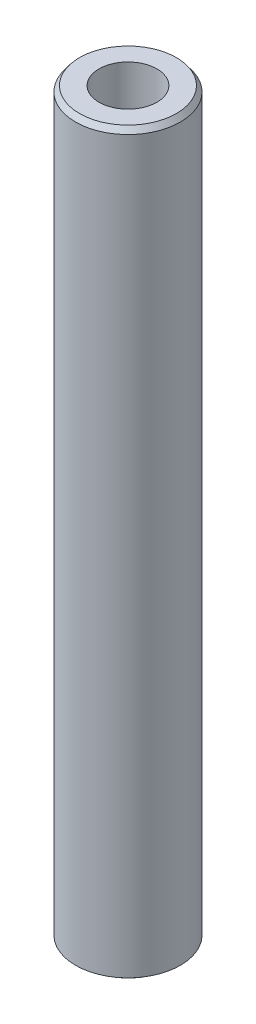
ISO-10303-21;
HEADER;
FILE_DESCRIPTION(('STEP AP214'),'2;1');
FILE_NAME('part.step','',(''),(''),'','','');
FILE_SCHEMA(('AUTOMOTIVE_DESIGN { 1 0 10303 214 1 1 1 1 }'));
ENDSEC;
DATA;
#1=APPLICATION_CONTEXT('core data for automotive mechanical design processes');
#2=APPLICATION_PROTOCOL_DEFINITION('international standard','automotive_design',2000,#1);
#3=PRODUCT_CONTEXT('',#1,'mechanical');
#4=PRODUCT('Part','Part','',(#3));
#5=PRODUCT_RELATED_PRODUCT_CATEGORY('part','',(#4));
#6=PRODUCT_DEFINITION_FORMATION('','',#4);
#7=PRODUCT_DEFINITION_CONTEXT('part definition',#1,'design');
#8=PRODUCT_DEFINITION('design','',#6,#7);
#9=PRODUCT_DEFINITION_SHAPE('','',#8);
#10=(LENGTH_UNIT() NAMED_UNIT(*) SI_UNIT(.MILLI.,.METRE.));
#11=(NAMED_UNIT(*) PLANE_ANGLE_UNIT() SI_UNIT($,.RADIAN.));
#12=(NAMED_UNIT(*) SI_UNIT($,.STERADIAN.) SOLID_ANGLE_UNIT());
#13=UNCERTAINTY_MEASURE_WITH_UNIT(LENGTH_MEASURE(1.E-05),#10,'distance_accuracy_value','');
#14=(GEOMETRIC_REPRESENTATION_CONTEXT(3) GLOBAL_UNCERTAINTY_ASSIGNED_CONTEXT((#13)) GLOBAL_UNIT_ASSIGNED_CONTEXT((#10,
#11,#12)) REPRESENTATION_CONTEXT('',''));
#15=CARTESIAN_POINT('',(0.,0.,0.));
#16=DIRECTION('',(0.,0.,1.));
#17=DIRECTION('',(1.,0.,0.));
#18=AXIS2_PLACEMENT_3D('',#15,#16,#17);
#19=CARTESIAN_POINT('',(0.,600.,0.));
#20=DIRECTION('',(0.,-1.,0.));
#21=DIRECTION('',(0.,0.,-1.));
#22=AXIS2_PLACEMENT_3D('',#19,#20,#21);
#23=CYLINDRICAL_SURFACE('',#22,42.5);
#24=CARTESIAN_POINT('',(0.,595.610001275517,0.));
#25=DIRECTION('',(0.,1.,0.));
#26=DIRECTION('',(0.,0.,1.));
#27=AXIS2_PLACEMENT_3D('',#24,#25,#26);
#28=CIRCLE('',#27,42.5);
#29=CARTESIAN_POINT('',(0.,595.610001275517,42.5));
#30=VERTEX_POINT('',#29);
#31=EDGE_CURVE('E50',#30,#30,#28,.F.);
#32=ORIENTED_EDGE('',*,*,#31,.T.);
#33=EDGE_LOOP('',(#32));
#34=FACE_BOUND('',#33,.T.);
#35=CARTESIAN_POINT('',(0.,3.19088644555399,0.));
#36=DIRECTION('',(0.,1.,0.));
#37=DIRECTION('',(0.,0.,1.));
#38=AXIS2_PLACEMENT_3D('',#35,#36,#37);
#39=CIRCLE('',#38,42.5);
#40=CARTESIAN_POINT('',(0.,3.19088644555399,42.5));
#41=VERTEX_POINT('',#40);
#42=EDGE_CURVE('E51',#41,#41,#39,.T.);
#43=ORIENTED_EDGE('',*,*,#42,.T.);
#44=EDGE_LOOP('',(#43));
#45=FACE_BOUND('',#44,.T.);
#46=ADVANCED_FACE('F39',(#34,#45),#23,.T.);
#47=CARTESIAN_POINT('',(0.,600.,0.));
#48=DIRECTION('',(0.,1.,0.));
#49=DIRECTION('',(0.,0.,1.));
#50=AXIS2_PLACEMENT_3D('',#47,#48,#49);
#51=PLANE('',#50);
#52=CARTESIAN_POINT('',(0.,600.,0.));
#53=DIRECTION('',(0.,1.,0.));
#54=DIRECTION('',(0.,0.,1.));
#55=AXIS2_PLACEMENT_3D('',#52,#53,#54);
#56=CIRCLE('',#55,39.3091135544461);
#57=CARTESIAN_POINT('',(0.,600.,39.3091135544461));
#58=VERTEX_POINT('',#57);
#59=EDGE_CURVE('E54',#58,#58,#56,.T.);
#60=ORIENTED_EDGE('',*,*,#59,.T.);
#61=EDGE_LOOP('',(#60));
#62=FACE_BOUND('',#61,.T.);
#63=CARTESIAN_POINT('',(0.,600.,0.));
#64=DIRECTION('',(0.,1.,0.));
#65=DIRECTION('',(0.,0.,1.));
#66=AXIS2_PLACEMENT_3D('',#63,#64,#65);
#67=CIRCLE('',#66,23.473898825766);
#68=CARTESIAN_POINT('',(0.,600.,23.473898825766));
#69=VERTEX_POINT('',#68);
#70=EDGE_CURVE('E58',#69,#69,#67,.T.);
#71=ORIENTED_EDGE('',*,*,#70,.F.);
#72=EDGE_LOOP('',(#71));
#73=FACE_BOUND('',#72,.T.);
#74=ADVANCED_FACE('F69',(#62,#73),#51,.T.);
#75=CARTESIAN_POINT('',(0.,0.,0.));
#76=DIRECTION('',(0.,1.,0.));
#77=DIRECTION('',(0.,0.,1.));
#78=AXIS2_PLACEMENT_3D('',#75,#76,#77);
#79=PLANE('',#78);
#80=CARTESIAN_POINT('',(0.,0.,0.));
#81=DIRECTION('',(0.,1.,0.));
#82=DIRECTION('',(0.,0.,1.));
#83=AXIS2_PLACEMENT_3D('',#80,#81,#82);
#84=CIRCLE('',#83,38.1100012755167);
#85=CARTESIAN_POINT('',(0.,0.,38.1100012755167));
#86=VERTEX_POINT('',#85);
#87=EDGE_CURVE('E10',#86,#86,#84,.F.);
#88=ORIENTED_EDGE('',*,*,#87,.T.);
#89=EDGE_LOOP('',(#88));
#90=FACE_BOUND('',#89,.T.);
#91=CARTESIAN_POINT('',(0.,0.,0.));
#92=DIRECTION('',(0.,1.,0.));
#93=DIRECTION('',(0.,0.,1.));
#94=AXIS2_PLACEMENT_3D('',#91,#92,#93);
#95=CIRCLE('',#94,23.473898825766);
#96=CARTESIAN_POINT('',(0.,0.,23.473898825766));
#97=VERTEX_POINT('',#96);
#98=EDGE_CURVE('E63',#97,#97,#95,.T.);
#99=ORIENTED_EDGE('',*,*,#98,.T.);
#100=EDGE_LOOP('',(#99));
#101=FACE_BOUND('',#100,.T.);
#102=ADVANCED_FACE('F75',(#90,#101),#79,.F.);
#103=CARTESIAN_POINT('',(0.,600.,0.));
#104=DIRECTION('',(0.,-1.,0.));
#105=DIRECTION('',(0.,0.,-1.));
#106=AXIS2_PLACEMENT_3D('',#103,#104,#105);
#107=CYLINDRICAL_SURFACE('',#106,23.473898825766);
#108=ORIENTED_EDGE('',*,*,#70,.T.);
#109=EDGE_LOOP('',(#108));
#110=FACE_BOUND('',#109,.T.);
#111=ORIENTED_EDGE('',*,*,#98,.F.);
#112=EDGE_LOOP('',(#111));
#113=FACE_BOUND('',#112,.T.);
#114=ADVANCED_FACE('F70',(#110,#113),#107,.F.);
#115=CARTESIAN_POINT('',(0.,600.,0.));
#116=DIRECTION('',(0.,-1.,0.));
#117=DIRECTION('',(0.,0.,-1.));
#118=AXIS2_PLACEMENT_3D('',#115,#116,#117);
#119=CONICAL_SURFACE('',#118,39.3091135544461,0.628522110100932);
#120=ORIENTED_EDGE('',*,*,#31,.F.);
#121=EDGE_LOOP('',(#120));
#122=FACE_BOUND('',#121,.T.);
#123=ORIENTED_EDGE('',*,*,#59,.F.);
#124=EDGE_LOOP('',(#123));
#125=FACE_BOUND('',#124,.T.);
#126=ADVANCED_FACE('F81',(#122,#125),#119,.T.);
#127=CARTESIAN_POINT('',(0.,3.19088644555399,0.));
#128=DIRECTION('',(0.,1.,0.));
#129=DIRECTION('',(0.,0.,1.));
#130=AXIS2_PLACEMENT_3D('',#127,#128,#129);
#131=CONICAL_SURFACE('',#130,42.5,0.942274216693969);
#132=CARTESIAN_POINT('',(0.,0.,38.1100012755167));
#133=CARTESIAN_POINT('',(0.,0.0332384004745203,38.1557304288967));
#134=CARTESIAN_POINT('',(0.,0.066476800949041,38.2014595822767));
#135=CARTESIAN_POINT('',(0.,0.132953601898082,38.2929178890368));
#136=CARTESIAN_POINT('',(0.,0.166192002372603,38.3386470424168));
#137=CARTESIAN_POINT('',(0.,0.232668803321644,38.4301053491769));
#138=CARTESIAN_POINT('',(0.,0.265907203796165,38.4758345025569));
#139=CARTESIAN_POINT('',(0.,0.332384004745206,38.567292809317));
#140=CARTESIAN_POINT('',(0.,0.365622405219727,38.6130219626971));
#141=CARTESIAN_POINT('',(0.,0.432099206168769,38.7044802694571));
#142=CARTESIAN_POINT('',(0.,0.46533760664329,38.7502094228372));
#143=CARTESIAN_POINT('',(0.,0.531814407592331,38.8416677295972));
#144=CARTESIAN_POINT('',(0.,0.565052808066851,38.8873968829773));
#145=CARTESIAN_POINT('',(0.,0.631529609015892,38.9788551897373));
#146=CARTESIAN_POINT('',(0.,0.664768009490413,39.0245843431174));
#147=CARTESIAN_POINT('',(0.,0.731244810439455,39.1160426498774));
#148=CARTESIAN_POINT('',(0.,0.764483210913976,39.1617718032575));
#149=CARTESIAN_POINT('',(0.,0.830960011863017,39.2532301100175));
#150=CARTESIAN_POINT('',(0.,0.864198412337538,39.2989592633976));
#151=CARTESIAN_POINT('',(0.,0.930675213286579,39.3904175701576));
#152=CARTESIAN_POINT('',(0.,0.9639136137611,39.4361467235377));
#153=CARTESIAN_POINT('',(0.,1.03039041471014,39.5276050302977));
#154=CARTESIAN_POINT('',(0.,1.06362881518466,39.5733341836778));
#155=CARTESIAN_POINT('',(0.,1.1301056161337,39.6647924904378));
#156=CARTESIAN_POINT('',(0.,1.16334401660822,39.7105216438179));
#157=CARTESIAN_POINT('',(0.,1.22982081755727,39.801979950578));
#158=CARTESIAN_POINT('',(0.,1.26305921803179,39.847709103958));
#159=CARTESIAN_POINT('',(0.,1.32953601898083,39.9391674107181));
#160=CARTESIAN_POINT('',(0.,1.36277441945535,39.9848965640981));
#161=CARTESIAN_POINT('',(0.,1.42925122040439,40.0763548708582));
#162=CARTESIAN_POINT('',(0.,1.46248962087891,40.1220840242382));
#163=CARTESIAN_POINT('',(0.,1.52896642182795,40.2135423309983));
#164=CARTESIAN_POINT('',(0.,1.56220482230247,40.2592714843783));
#165=CARTESIAN_POINT('',(0.,1.62868162325151,40.3507297911384));
#166=CARTESIAN_POINT('',(0.,1.66192002372603,40.3964589445184));
#167=CARTESIAN_POINT('',(0.,1.72839682467508,40.4879172512785));
#168=CARTESIAN_POINT('',(0.,1.7616352251496,40.5336464046585));
#169=CARTESIAN_POINT('',(0.,1.82811202609864,40.6251047114186));
#170=CARTESIAN_POINT('',(0.,1.86135042657316,40.6708338647986));
#171=CARTESIAN_POINT('',(0.,1.9278272275222,40.7622921715587));
#172=CARTESIAN_POINT('',(0.,1.96106562799672,40.8080213249387));
#173=CARTESIAN_POINT('',(0.,2.02754242894576,40.8994796316988));
#174=CARTESIAN_POINT('',(0.,2.06078082942028,40.9452087850788));
#175=CARTESIAN_POINT('',(0.,2.12725763036932,41.0366670918389));
#176=CARTESIAN_POINT('',(0.,2.16049603084385,41.0823962452189));
#177=CARTESIAN_POINT('',(0.,2.22697283179289,41.173854551979));
#178=CARTESIAN_POINT('',(0.,2.26021123226741,41.219583705359));
#179=CARTESIAN_POINT('',(0.,2.32668803321645,41.3110420121191));
#180=CARTESIAN_POINT('',(0.,2.35992643369097,41.3567711654991));
#181=CARTESIAN_POINT('',(0.,2.42640323464001,41.4482294722592));
#182=CARTESIAN_POINT('',(0.,2.45964163511453,41.4939586256392));
#183=CARTESIAN_POINT('',(0.,2.52611843606357,41.5854169323993));
#184=CARTESIAN_POINT('',(0.,2.55935683653809,41.6311460857793));
#185=CARTESIAN_POINT('',(0.,2.62583363748713,41.7226043925394));
#186=CARTESIAN_POINT('',(0.,2.65907203796166,41.7683335459195));
#187=CARTESIAN_POINT('',(0.,2.7255488389107,41.8597918526795));
#188=CARTESIAN_POINT('',(0.,2.75878723938522,41.9055210060596));
#189=CARTESIAN_POINT('',(0.,2.82526404033426,41.9969793128196));
#190=CARTESIAN_POINT('',(0.,2.85850244080878,42.0427084661997));
#191=CARTESIAN_POINT('',(0.,2.92497924175782,42.1341667729597));
#192=CARTESIAN_POINT('',(0.,2.95821764223234,42.1798959263398));
#193=CARTESIAN_POINT('',(0.,3.02469444318138,42.2713542330998));
#194=CARTESIAN_POINT('',(0.,3.0579328436559,42.3170833864799));
#195=CARTESIAN_POINT('',(0.,3.12440964460495,42.4085416932399));
#196=CARTESIAN_POINT('',(0.,3.15764804507947,42.45427084662));
#197=CARTESIAN_POINT('',(0.,3.19088644555399,42.5));
#198=B_SPLINE_CURVE_WITH_KNOTS('',3,(#132,#133,#134,#135,#136,#137,#138,#139,#140,#141,#142,
#143,#144,#145,#146,#147,#148,#149,#150,#151,#152,#153,#154,#155,#156,#157,#158,#159,#160,#161,
#162,#163,#164,#165,#166,#167,#168,#169,#170,#171,#172,#173,#174,#175,#176,#177,#178,#179,#180,
#181,#182,#183,#184,#185,#186,#187,#188,#189,#190,#191,#192,#193,#194,#195,#196,#197),
.UNSPECIFIED.,.F.,.F.,(4,2,2,2,2,2,2,2,2,2,2,2,2,2,2,2,2,2,2,2,2,2,2,2,2,2,2,2,2,2,2,2,4),(0.,
0.169598115009083,0.339196230018165,0.508794345027248,0.678392460036331,0.847990575045414,
1.0175886900545,1.18718680506358,1.35678492007267,1.52638303508175,1.69598115009083,
1.86557926509992,2.035177380109,2.20477549511809,2.37437361012717,2.54397172513625,
2.71356984014533,2.88316795515442,3.0527660701635,3.22236418517258,3.39196230018166,
3.56156041519075,3.73115853019984,3.90075664520892,4.070354760218,4.23995287522708,
4.40955099023617,4.57914910524525,4.74874722025434,4.91834533526342,5.0879434502725,
5.25754156528159,5.42713968029067),.UNSPECIFIED.);
#199=EDGE_CURVE('BSEAM45',#86,#41,#198,.T.);
#200=ORIENTED_EDGE('',*,*,#87,.F.);
#201=ORIENTED_EDGE('',*,*,#42,.F.);
#202=ORIENTED_EDGE('',*,*,#199,.T.);
#203=ORIENTED_EDGE('',*,*,#199,.F.);
#204=EDGE_LOOP('',(#200,#202,#201,#203));
#205=FACE_BOUND('',#204,.T.);
#206=ADVANCED_FACE('F45',(#205),#131,.T.);
#207=CLOSED_SHELL('',(#46,#74,#102,#114,#126,#206));
#208=MANIFOLD_SOLID_BREP('B2',#207);
#209=ADVANCED_BREP_SHAPE_REPRESENTATION('',(#18,#208),#14);
#210=SHAPE_DEFINITION_REPRESENTATION(#9,#209);
ENDSEC;
END-ISO-10303-21;
